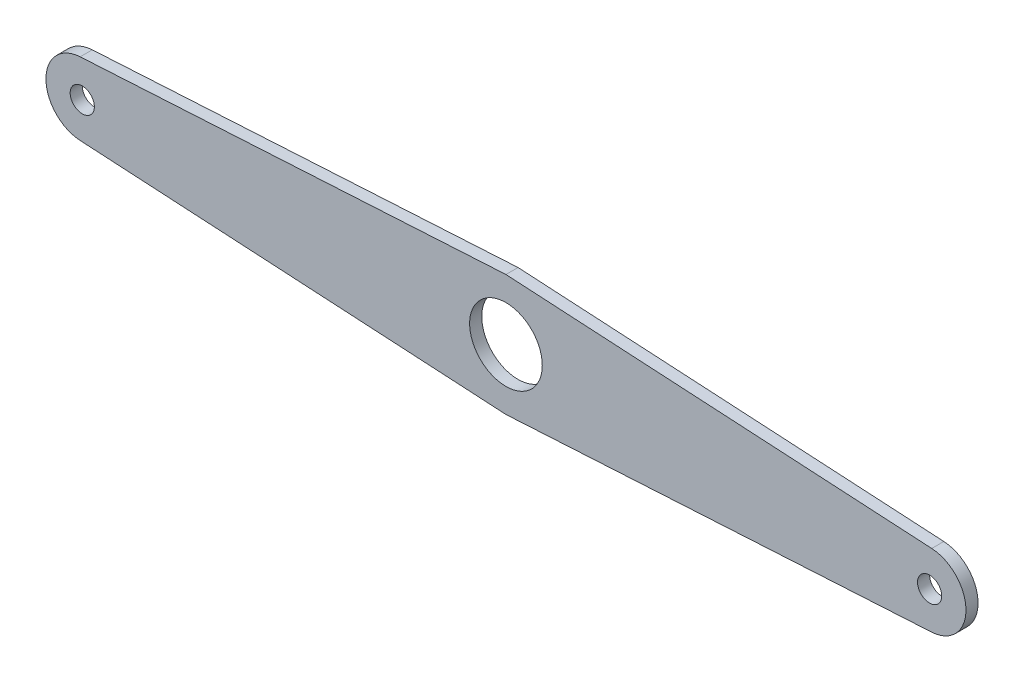
ISO-10303-21;
HEADER;
FILE_DESCRIPTION(('STEP AP214'),'2;1');
FILE_NAME('part.step','',(''),(''),'','','');
FILE_SCHEMA(('AUTOMOTIVE_DESIGN { 1 0 10303 214 1 1 1 1 }'));
ENDSEC;
DATA;
#1=APPLICATION_CONTEXT('core data for automotive mechanical design processes');
#2=APPLICATION_PROTOCOL_DEFINITION('international standard','automotive_design',2000,#1);
#3=PRODUCT_CONTEXT('',#1,'mechanical');
#4=PRODUCT('Part','Part','',(#3));
#5=PRODUCT_RELATED_PRODUCT_CATEGORY('part','',(#4));
#6=PRODUCT_DEFINITION_FORMATION('','',#4);
#7=PRODUCT_DEFINITION_CONTEXT('part definition',#1,'design');
#8=PRODUCT_DEFINITION('design','',#6,#7);
#9=PRODUCT_DEFINITION_SHAPE('','',#8);
#10=(LENGTH_UNIT() NAMED_UNIT(*) SI_UNIT(.MILLI.,.METRE.));
#11=(NAMED_UNIT(*) PLANE_ANGLE_UNIT() SI_UNIT($,.RADIAN.));
#12=(NAMED_UNIT(*) SI_UNIT($,.STERADIAN.) SOLID_ANGLE_UNIT());
#13=UNCERTAINTY_MEASURE_WITH_UNIT(LENGTH_MEASURE(1.E-05),#10,'distance_accuracy_value','');
#14=(GEOMETRIC_REPRESENTATION_CONTEXT(3) GLOBAL_UNCERTAINTY_ASSIGNED_CONTEXT((#13)) GLOBAL_UNIT_ASSIGNED_CONTEXT((#10,
#11,#12)) REPRESENTATION_CONTEXT('',''));
#15=CARTESIAN_POINT('',(0.,0.,0.));
#16=DIRECTION('',(0.,0.,1.));
#17=DIRECTION('',(1.,0.,0.));
#18=AXIS2_PLACEMENT_3D('',#15,#16,#17);
#19=CARTESIAN_POINT('',(175.,0.,5.));
#20=DIRECTION('',(0.,0.,-1.));
#21=DIRECTION('',(-1.,0.,0.));
#22=AXIS2_PLACEMENT_3D('',#19,#20,#21);
#23=CYLINDRICAL_SURFACE('',#22,15.);
#24=CARTESIAN_POINT('',(175.,0.,0.));
#25=DIRECTION('',(0.,0.,1.));
#26=DIRECTION('',(1.,0.,0.));
#27=AXIS2_PLACEMENT_3D('',#24,#25,#26);
#28=CIRCLE('',#27,15.);
#29=CARTESIAN_POINT('',(175.857142857143,14.9754901797053,0.));
#30=VERTEX_POINT('',#29);
#31=CARTESIAN_POINT('',(175.857142857143,-14.9754901797053,0.));
#32=VERTEX_POINT('',#31);
#33=EDGE_CURVE('E146',#30,#32,#28,.F.);
#34=ORIENTED_EDGE('',*,*,#33,.F.);
#35=DIRECTION('',(0.,0.,-1.));
#36=VECTOR('',#35,1.);
#37=CARTESIAN_POINT('',(175.857142857143,14.9754901797053,5.));
#38=LINE('',#37,#36);
#39=CARTESIAN_POINT('',(175.857142857143,14.9754901797053,5.));
#40=VERTEX_POINT('',#39);
#41=EDGE_CURVE('E11',#40,#30,#38,.T.);
#42=ORIENTED_EDGE('',*,*,#41,.F.);
#43=CARTESIAN_POINT('',(175.,0.,5.));
#44=DIRECTION('',(0.,0.,1.));
#45=DIRECTION('',(1.,0.,0.));
#46=AXIS2_PLACEMENT_3D('',#43,#44,#45);
#47=CIRCLE('',#46,15.);
#48=CARTESIAN_POINT('',(175.857142857143,-14.9754901797053,5.));
#49=VERTEX_POINT('',#48);
#50=EDGE_CURVE('E178',#40,#49,#47,.F.);
#51=ORIENTED_EDGE('',*,*,#50,.T.);
#52=DIRECTION('',(0.,0.,-1.));
#53=VECTOR('',#52,1.);
#54=CARTESIAN_POINT('',(175.857142857143,-14.9754901797053,5.));
#55=LINE('',#54,#53);
#56=EDGE_CURVE('E64',#49,#32,#55,.T.);
#57=ORIENTED_EDGE('',*,*,#56,.T.);
#58=EDGE_LOOP('',(#34,#42,#51,#57));
#59=FACE_BOUND('',#58,.T.);
#60=ADVANCED_FACE('F47',(#59),#23,.T.);
#61=CARTESIAN_POINT('',(1.42857142857143,24.9591502995088,5.));
#62=DIRECTION('',(-0.0571428571428571,-0.998366011980351,0.));
#63=DIRECTION('',(0.998366011980351,-0.0571428571428571,0.));
#64=AXIS2_PLACEMENT_3D('',#61,#62,#63);
#65=PLANE('',#64);
#66=DIRECTION('',(-0.998366011980351,0.0571428571428571,0.));
#67=VECTOR('',#66,1.);
#68=CARTESIAN_POINT('',(1.42857142857143,24.9591502995088,0.));
#69=LINE('',#68,#67);
#70=CARTESIAN_POINT('',(0.,25.0409165576562,0.));
#71=VERTEX_POINT('',#70);
#72=EDGE_CURVE('E149',#30,#71,#69,.T.);
#73=ORIENTED_EDGE('',*,*,#72,.T.);
#74=DIRECTION('',(0.,0.,-1.));
#75=VECTOR('',#74,1.);
#76=CARTESIAN_POINT('',(0.,25.0409165576562,5.));
#77=LINE('',#76,#75);
#78=CARTESIAN_POINT('',(0.,25.0409165576562,5.));
#79=VERTEX_POINT('',#78);
#80=EDGE_CURVE('E56',#79,#71,#77,.T.);
#81=ORIENTED_EDGE('',*,*,#80,.F.);
#82=DIRECTION('',(-0.998366011980351,0.0571428571428571,0.));
#83=VECTOR('',#82,1.);
#84=CARTESIAN_POINT('',(1.42857142857143,24.9591502995088,5.));
#85=LINE('',#84,#83);
#86=EDGE_CURVE('E301',#40,#79,#85,.T.);
#87=ORIENTED_EDGE('',*,*,#86,.F.);
#88=ORIENTED_EDGE('',*,*,#41,.T.);
#89=EDGE_LOOP('',(#73,#81,#87,#88));
#90=FACE_BOUND('',#89,.T.);
#91=ADVANCED_FACE('F191',(#90),#65,.F.);
#92=CARTESIAN_POINT('',(-1.42857142857143,24.9591502995088,5.));
#93=DIRECTION('',(-0.0571428571428571,0.998366011980351,0.));
#94=DIRECTION('',(-0.998366011980351,-0.0571428571428571,0.));
#95=AXIS2_PLACEMENT_3D('',#92,#93,#94);
#96=PLANE('',#95);
#97=DIRECTION('',(0.998366011980351,0.0571428571428571,0.));
#98=VECTOR('',#97,1.);
#99=CARTESIAN_POINT('',(-1.42857142857143,24.9591502995088,0.));
#100=LINE('',#99,#98);
#101=CARTESIAN_POINT('',(-175.857142857143,14.9754901797053,0.));
#102=VERTEX_POINT('',#101);
#103=EDGE_CURVE('E153',#102,#71,#100,.T.);
#104=ORIENTED_EDGE('',*,*,#103,.F.);
#105=DIRECTION('',(0.,0.,-1.));
#106=VECTOR('',#105,1.);
#107=CARTESIAN_POINT('',(-175.857142857143,14.9754901797053,5.));
#108=LINE('',#107,#106);
#109=CARTESIAN_POINT('',(-175.857142857143,14.9754901797053,5.));
#110=VERTEX_POINT('',#109);
#111=EDGE_CURVE('E124',#110,#102,#108,.T.);
#112=ORIENTED_EDGE('',*,*,#111,.F.);
#113=DIRECTION('',(0.998366011980351,0.0571428571428571,0.));
#114=VECTOR('',#113,1.);
#115=CARTESIAN_POINT('',(-1.42857142857143,24.9591502995088,5.));
#116=LINE('',#115,#114);
#117=EDGE_CURVE('E112',#110,#79,#116,.T.);
#118=ORIENTED_EDGE('',*,*,#117,.T.);
#119=ORIENTED_EDGE('',*,*,#80,.T.);
#120=EDGE_LOOP('',(#104,#112,#118,#119));
#121=FACE_BOUND('',#120,.T.);
#122=ADVANCED_FACE('F188',(#121),#96,.T.);
#123=CARTESIAN_POINT('',(-175.,0.,5.));
#124=DIRECTION('',(0.,0.,-1.));
#125=DIRECTION('',(-1.,0.,0.));
#126=AXIS2_PLACEMENT_3D('',#123,#124,#125);
#127=CYLINDRICAL_SURFACE('',#126,15.);
#128=CARTESIAN_POINT('',(-175.,0.,0.));
#129=DIRECTION('',(0.,0.,1.));
#130=DIRECTION('',(1.,0.,0.));
#131=AXIS2_PLACEMENT_3D('',#128,#129,#130);
#132=CIRCLE('',#131,15.);
#133=CARTESIAN_POINT('',(-175.857142857143,-14.9754901797053,0.));
#134=VERTEX_POINT('',#133);
#135=EDGE_CURVE('E120',#102,#134,#132,.T.);
#136=ORIENTED_EDGE('',*,*,#135,.T.);
#137=DIRECTION('',(0.,0.,-1.));
#138=VECTOR('',#137,1.);
#139=CARTESIAN_POINT('',(-175.857142857143,-14.9754901797053,5.));
#140=LINE('',#139,#138);
#141=CARTESIAN_POINT('',(-175.857142857143,-14.9754901797053,5.));
#142=VERTEX_POINT('',#141);
#143=EDGE_CURVE('E117',#142,#134,#140,.T.);
#144=ORIENTED_EDGE('',*,*,#143,.F.);
#145=CARTESIAN_POINT('',(-175.,0.,5.));
#146=DIRECTION('',(0.,0.,1.));
#147=DIRECTION('',(1.,0.,0.));
#148=AXIS2_PLACEMENT_3D('',#145,#146,#147);
#149=CIRCLE('',#148,15.);
#150=EDGE_CURVE('E103',#110,#142,#149,.T.);
#151=ORIENTED_EDGE('',*,*,#150,.F.);
#152=ORIENTED_EDGE('',*,*,#111,.T.);
#153=EDGE_LOOP('',(#136,#144,#151,#152));
#154=FACE_BOUND('',#153,.T.);
#155=ADVANCED_FACE('F118',(#154),#127,.T.);
#156=CARTESIAN_POINT('',(-1.42857142857143,-24.9591502995088,5.));
#157=DIRECTION('',(0.0571428571428571,0.998366011980351,0.));
#158=DIRECTION('',(-0.998366011980351,0.0571428571428571,0.));
#159=AXIS2_PLACEMENT_3D('',#156,#157,#158);
#160=PLANE('',#159);
#161=DIRECTION('',(0.998366011980351,-0.0571428571428571,0.));
#162=VECTOR('',#161,1.);
#163=CARTESIAN_POINT('',(-1.42857142857143,-24.9591502995088,0.));
#164=LINE('',#163,#162);
#165=CARTESIAN_POINT('',(0.,-25.0409165576562,0.));
#166=VERTEX_POINT('',#165);
#167=EDGE_CURVE('E159',#134,#166,#164,.T.);
#168=ORIENTED_EDGE('',*,*,#167,.T.);
#169=DIRECTION('',(0.,0.,-1.));
#170=VECTOR('',#169,1.);
#171=CARTESIAN_POINT('',(0.,-25.0409165576562,5.));
#172=LINE('',#171,#170);
#173=CARTESIAN_POINT('',(0.,-25.0409165576562,5.));
#174=VERTEX_POINT('',#173);
#175=EDGE_CURVE('E84',#174,#166,#172,.T.);
#176=ORIENTED_EDGE('',*,*,#175,.F.);
#177=DIRECTION('',(0.998366011980351,-0.0571428571428571,0.));
#178=VECTOR('',#177,1.);
#179=CARTESIAN_POINT('',(-1.42857142857143,-24.9591502995088,5.));
#180=LINE('',#179,#178);
#181=EDGE_CURVE('E110',#142,#174,#180,.T.);
#182=ORIENTED_EDGE('',*,*,#181,.F.);
#183=ORIENTED_EDGE('',*,*,#143,.T.);
#184=EDGE_LOOP('',(#168,#176,#182,#183));
#185=FACE_BOUND('',#184,.T.);
#186=ADVANCED_FACE('F126',(#185),#160,.F.);
#187=CARTESIAN_POINT('',(175.,0.,5.));
#188=DIRECTION('',(0.,0.,-1.));
#189=DIRECTION('',(-1.,0.,0.));
#190=AXIS2_PLACEMENT_3D('',#187,#188,#189);
#191=CYLINDRICAL_SURFACE('',#190,4.99999999999999);
#192=CARTESIAN_POINT('',(175.,0.,5.));
#193=DIRECTION('',(0.,0.,1.));
#194=DIRECTION('',(1.,0.,0.));
#195=AXIS2_PLACEMENT_3D('',#192,#193,#194);
#196=CIRCLE('',#195,4.99999999999999);
#197=CARTESIAN_POINT('',(180.,0.,5.));
#198=VERTEX_POINT('',#197);
#199=EDGE_CURVE('E138',#198,#198,#196,.T.);
#200=ORIENTED_EDGE('',*,*,#199,.T.);
#201=EDGE_LOOP('',(#200));
#202=FACE_BOUND('',#201,.T.);
#203=CARTESIAN_POINT('',(175.,0.,0.));
#204=DIRECTION('',(0.,0.,1.));
#205=DIRECTION('',(1.,0.,0.));
#206=AXIS2_PLACEMENT_3D('',#203,#204,#205);
#207=CIRCLE('',#206,4.99999999999999);
#208=CARTESIAN_POINT('',(180.,0.,0.));
#209=VERTEX_POINT('',#208);
#210=EDGE_CURVE('E170',#209,#209,#207,.T.);
#211=ORIENTED_EDGE('',*,*,#210,.F.);
#212=EDGE_LOOP('',(#211));
#213=FACE_BOUND('',#212,.T.);
#214=ADVANCED_FACE('F206',(#202,#213),#191,.F.);
#215=CARTESIAN_POINT('',(0.,0.,5.));
#216=DIRECTION('',(0.,0.,-1.));
#217=DIRECTION('',(-1.,0.,0.));
#218=AXIS2_PLACEMENT_3D('',#215,#216,#217);
#219=CYLINDRICAL_SURFACE('',#218,15.);
#220=CARTESIAN_POINT('',(0.,0.,5.));
#221=DIRECTION('',(0.,0.,1.));
#222=DIRECTION('',(1.,0.,0.));
#223=AXIS2_PLACEMENT_3D('',#220,#221,#222);
#224=CIRCLE('',#223,15.);
#225=CARTESIAN_POINT('',(15.,0.,5.));
#226=VERTEX_POINT('',#225);
#227=EDGE_CURVE('E131',#226,#226,#224,.T.);
#228=ORIENTED_EDGE('',*,*,#227,.T.);
#229=EDGE_LOOP('',(#228));
#230=FACE_BOUND('',#229,.T.);
#231=CARTESIAN_POINT('',(0.,0.,0.));
#232=DIRECTION('',(0.,0.,1.));
#233=DIRECTION('',(1.,0.,0.));
#234=AXIS2_PLACEMENT_3D('',#231,#232,#233);
#235=CIRCLE('',#234,15.);
#236=CARTESIAN_POINT('',(15.,0.,0.));
#237=VERTEX_POINT('',#236);
#238=EDGE_CURVE('E166',#237,#237,#235,.T.);
#239=ORIENTED_EDGE('',*,*,#238,.F.);
#240=EDGE_LOOP('',(#239));
#241=FACE_BOUND('',#240,.T.);
#242=ADVANCED_FACE('F198',(#230,#241),#219,.F.);
#243=CARTESIAN_POINT('',(1.42857142857143,-24.9591502995088,5.));
#244=DIRECTION('',(0.0571428571428571,-0.998366011980351,0.));
#245=DIRECTION('',(0.998366011980351,0.0571428571428571,0.));
#246=AXIS2_PLACEMENT_3D('',#243,#244,#245);
#247=PLANE('',#246);
#248=DIRECTION('',(-0.998366011980351,-0.0571428571428571,0.));
#249=VECTOR('',#248,1.);
#250=CARTESIAN_POINT('',(1.42857142857143,-24.9591502995088,0.));
#251=LINE('',#250,#249);
#252=EDGE_CURVE('E162',#32,#166,#251,.T.);
#253=ORIENTED_EDGE('',*,*,#252,.F.);
#254=ORIENTED_EDGE('',*,*,#56,.F.);
#255=DIRECTION('',(-0.998366011980351,-0.0571428571428571,0.));
#256=VECTOR('',#255,1.);
#257=CARTESIAN_POINT('',(1.42857142857143,-24.9591502995088,5.));
#258=LINE('',#257,#256);
#259=EDGE_CURVE('E128',#49,#174,#258,.T.);
#260=ORIENTED_EDGE('',*,*,#259,.T.);
#261=ORIENTED_EDGE('',*,*,#175,.T.);
#262=EDGE_LOOP('',(#253,#254,#260,#261));
#263=FACE_BOUND('',#262,.T.);
#264=ADVANCED_FACE('F195',(#263),#247,.T.);
#265=CARTESIAN_POINT('',(-175.,0.,5.));
#266=DIRECTION('',(0.,0.,-1.));
#267=DIRECTION('',(-1.,0.,0.));
#268=AXIS2_PLACEMENT_3D('',#265,#266,#267);
#269=CYLINDRICAL_SURFACE('',#268,4.99999999999999);
#270=CARTESIAN_POINT('',(-175.,0.,5.));
#271=DIRECTION('',(0.,0.,1.));
#272=DIRECTION('',(1.,0.,0.));
#273=AXIS2_PLACEMENT_3D('',#270,#271,#272);
#274=CIRCLE('',#273,4.99999999999999);
#275=CARTESIAN_POINT('',(-170.,0.,5.));
#276=VERTEX_POINT('',#275);
#277=EDGE_CURVE('E142',#276,#276,#274,.T.);
#278=ORIENTED_EDGE('',*,*,#277,.T.);
#279=EDGE_LOOP('',(#278));
#280=FACE_BOUND('',#279,.T.);
#281=CARTESIAN_POINT('',(-175.,0.,0.));
#282=DIRECTION('',(0.,0.,1.));
#283=DIRECTION('',(1.,0.,0.));
#284=AXIS2_PLACEMENT_3D('',#281,#282,#283);
#285=CIRCLE('',#284,4.99999999999999);
#286=CARTESIAN_POINT('',(-170.,0.,0.));
#287=VERTEX_POINT('',#286);
#288=EDGE_CURVE('E174',#287,#287,#285,.T.);
#289=ORIENTED_EDGE('',*,*,#288,.F.);
#290=EDGE_LOOP('',(#289));
#291=FACE_BOUND('',#290,.T.);
#292=ADVANCED_FACE('F197',(#280,#291),#269,.F.);
#293=CARTESIAN_POINT('',(0.,0.,5.));
#294=DIRECTION('',(0.,0.,1.));
#295=DIRECTION('',(1.,0.,0.));
#296=AXIS2_PLACEMENT_3D('',#293,#294,#295);
#297=PLANE('',#296);
#298=ORIENTED_EDGE('',*,*,#50,.F.);
#299=ORIENTED_EDGE('',*,*,#86,.T.);
#300=ORIENTED_EDGE('',*,*,#117,.F.);
#301=ORIENTED_EDGE('',*,*,#150,.T.);
#302=ORIENTED_EDGE('',*,*,#181,.T.);
#303=ORIENTED_EDGE('',*,*,#259,.F.);
#304=EDGE_LOOP('',(#298,#299,#300,#301,#302,#303));
#305=FACE_BOUND('',#304,.T.);
#306=ORIENTED_EDGE('',*,*,#227,.F.);
#307=EDGE_LOOP('',(#306));
#308=FACE_BOUND('',#307,.T.);
#309=ORIENTED_EDGE('',*,*,#199,.F.);
#310=EDGE_LOOP('',(#309));
#311=FACE_BOUND('',#310,.T.);
#312=ORIENTED_EDGE('',*,*,#277,.F.);
#313=EDGE_LOOP('',(#312));
#314=FACE_BOUND('',#313,.T.);
#315=ADVANCED_FACE('F106',(#305,#308,#311,#314),#297,.T.);
#316=CARTESIAN_POINT('',(0.,0.,0.));
#317=DIRECTION('',(0.,0.,1.));
#318=DIRECTION('',(1.,0.,0.));
#319=AXIS2_PLACEMENT_3D('',#316,#317,#318);
#320=PLANE('',#319);
#321=ORIENTED_EDGE('',*,*,#33,.T.);
#322=ORIENTED_EDGE('',*,*,#252,.T.);
#323=ORIENTED_EDGE('',*,*,#167,.F.);
#324=ORIENTED_EDGE('',*,*,#135,.F.);
#325=ORIENTED_EDGE('',*,*,#103,.T.);
#326=ORIENTED_EDGE('',*,*,#72,.F.);
#327=EDGE_LOOP('',(#321,#322,#323,#324,#325,#326));
#328=FACE_BOUND('',#327,.T.);
#329=ORIENTED_EDGE('',*,*,#238,.T.);
#330=EDGE_LOOP('',(#329));
#331=FACE_BOUND('',#330,.T.);
#332=ORIENTED_EDGE('',*,*,#210,.T.);
#333=EDGE_LOOP('',(#332));
#334=FACE_BOUND('',#333,.T.);
#335=ORIENTED_EDGE('',*,*,#288,.T.);
#336=EDGE_LOOP('',(#335));
#337=FACE_BOUND('',#336,.T.);
#338=ADVANCED_FACE('F193',(#328,#331,#334,#337),#320,.F.);
#339=CLOSED_SHELL('',(#60,#91,#122,#155,#186,#214,#242,#264,#292,#315,#338));
#340=MANIFOLD_SOLID_BREP('B2',#339);
#341=ADVANCED_BREP_SHAPE_REPRESENTATION('',(#18,#340),#14);
#342=SHAPE_DEFINITION_REPRESENTATION(#9,#341);
ENDSEC;
END-ISO-10303-21;
